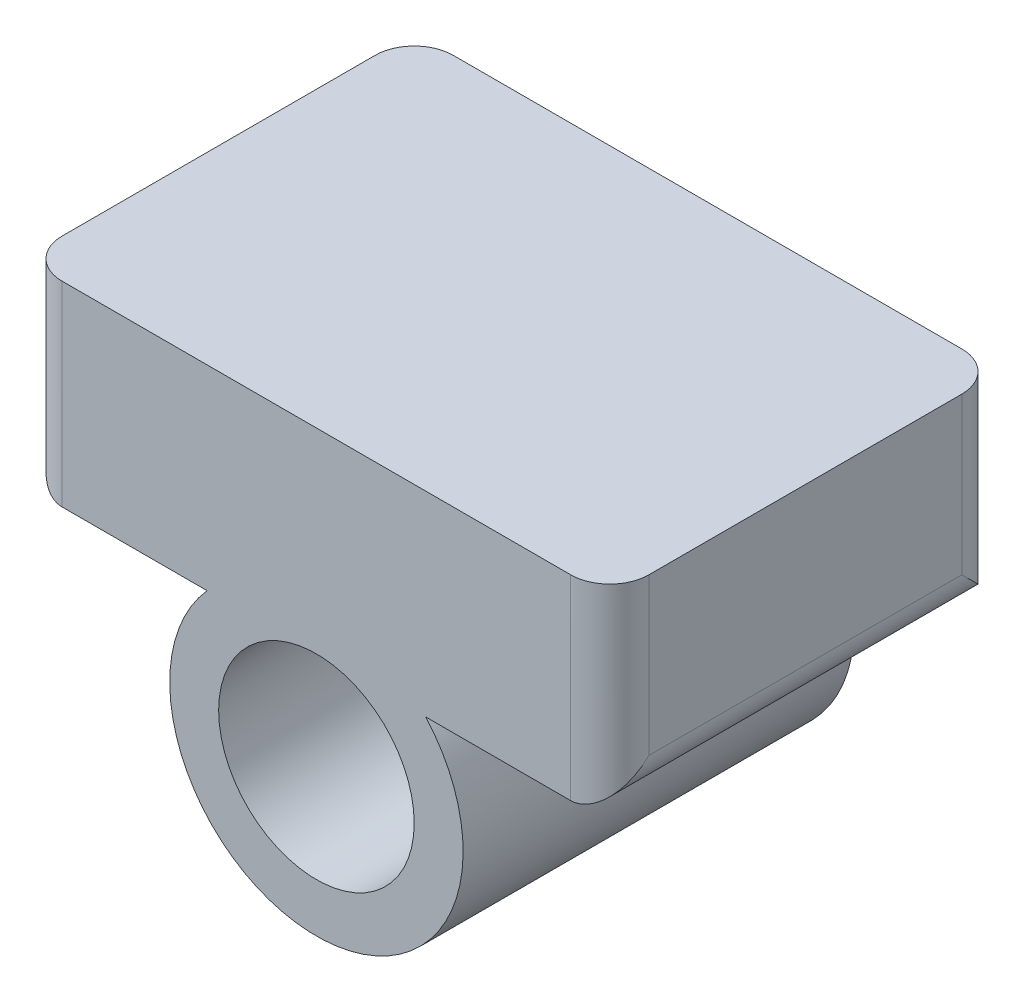
ISO-10303-21;
HEADER;
FILE_DESCRIPTION(('STEP AP214'),'2;1');
FILE_NAME('part.step','',(''),(''),'','','');
FILE_SCHEMA(('AUTOMOTIVE_DESIGN { 1 0 10303 214 1 1 1 1 }'));
ENDSEC;
DATA;
#1=APPLICATION_CONTEXT('core data for automotive mechanical design processes');
#2=APPLICATION_PROTOCOL_DEFINITION('international standard','automotive_design',2000,#1);
#3=PRODUCT_CONTEXT('',#1,'mechanical');
#4=PRODUCT('Part','Part','',(#3));
#5=PRODUCT_RELATED_PRODUCT_CATEGORY('part','',(#4));
#6=PRODUCT_DEFINITION_FORMATION('','',#4);
#7=PRODUCT_DEFINITION_CONTEXT('part definition',#1,'design');
#8=PRODUCT_DEFINITION('design','',#6,#7);
#9=PRODUCT_DEFINITION_SHAPE('','',#8);
#10=(LENGTH_UNIT() NAMED_UNIT(*) SI_UNIT(.MILLI.,.METRE.));
#11=(NAMED_UNIT(*) PLANE_ANGLE_UNIT() SI_UNIT($,.RADIAN.));
#12=(NAMED_UNIT(*) SI_UNIT($,.STERADIAN.) SOLID_ANGLE_UNIT());
#13=UNCERTAINTY_MEASURE_WITH_UNIT(LENGTH_MEASURE(1.E-05),#10,'distance_accuracy_value','');
#14=(GEOMETRIC_REPRESENTATION_CONTEXT(3) GLOBAL_UNCERTAINTY_ASSIGNED_CONTEXT((#13)) GLOBAL_UNIT_ASSIGNED_CONTEXT((#10,
#11,#12)) REPRESENTATION_CONTEXT('',''));
#15=CARTESIAN_POINT('',(0.,0.,0.));
#16=DIRECTION('',(0.,0.,1.));
#17=DIRECTION('',(1.,0.,0.));
#18=AXIS2_PLACEMENT_3D('',#15,#16,#17);
#19=CARTESIAN_POINT('',(0.,5.,20.));
#20=DIRECTION('',(0.,-1.,0.));
#21=DIRECTION('',(0.,0.,-1.));
#22=AXIS2_PLACEMENT_3D('',#19,#20,#21);
#23=PLANE('',#22);
#24=DIRECTION('',(-1.,0.,0.));
#25=VECTOR('',#24,1.);
#26=CARTESIAN_POINT('',(0.,5.,20.));
#27=LINE('',#26,#25);
#28=CARTESIAN_POINT('',(-5.59016994374948,5.,20.));
#29=VERTEX_POINT('',#28);
#30=CARTESIAN_POINT('',(-13.,5.,20.));
#31=VERTEX_POINT('',#30);
#32=EDGE_CURVE('E119',#29,#31,#27,.T.);
#33=ORIENTED_EDGE('',*,*,#32,.T.);
#34=DIRECTION('',(0.,0.,-1.));
#35=VECTOR('',#34,1.);
#36=CARTESIAN_POINT('',(-13.,5.,20.));
#37=LINE('',#36,#35);
#38=CARTESIAN_POINT('',(-13.,5.,0.));
#39=VERTEX_POINT('',#38);
#40=EDGE_CURVE('E173',#31,#39,#37,.T.);
#41=ORIENTED_EDGE('',*,*,#40,.T.);
#42=DIRECTION('',(-1.,0.,0.));
#43=VECTOR('',#42,1.);
#44=CARTESIAN_POINT('',(0.,5.,0.));
#45=LINE('',#44,#43);
#46=CARTESIAN_POINT('',(-5.59016994374948,5.,0.));
#47=VERTEX_POINT('',#46);
#48=EDGE_CURVE('E122',#47,#39,#45,.T.);
#49=ORIENTED_EDGE('',*,*,#48,.F.);
#50=DIRECTION('',(0.,0.,-1.));
#51=VECTOR('',#50,1.);
#52=CARTESIAN_POINT('',(-5.59016994374948,5.,20.));
#53=LINE('',#52,#51);
#54=EDGE_CURVE('E115',#29,#47,#53,.T.);
#55=ORIENTED_EDGE('',*,*,#54,.F.);
#56=EDGE_LOOP('',(#33,#41,#49,#55));
#57=FACE_BOUND('',#56,.T.);
#58=ADVANCED_FACE('F35',(#57),#23,.T.);
#59=CARTESIAN_POINT('',(0.,0.,20.));
#60=DIRECTION('',(0.,0.,-1.));
#61=DIRECTION('',(-1.,0.,0.));
#62=AXIS2_PLACEMENT_3D('',#59,#60,#61);
#63=CYLINDRICAL_SURFACE('',#62,7.5);
#64=CARTESIAN_POINT('',(0.,0.,0.));
#65=DIRECTION('',(0.,0.,1.));
#66=DIRECTION('',(1.,0.,0.));
#67=AXIS2_PLACEMENT_3D('',#64,#65,#66);
#68=CIRCLE('',#67,7.5);
#69=CARTESIAN_POINT('',(5.59016994374948,5.,0.));
#70=VERTEX_POINT('',#69);
#71=EDGE_CURVE('E157',#47,#70,#68,.T.);
#72=ORIENTED_EDGE('',*,*,#71,.T.);
#73=DIRECTION('',(0.,0.,-1.));
#74=VECTOR('',#73,1.);
#75=CARTESIAN_POINT('',(5.59016994374948,5.,20.));
#76=LINE('',#75,#74);
#77=CARTESIAN_POINT('',(5.59016994374948,5.,20.));
#78=VERTEX_POINT('',#77);
#79=EDGE_CURVE('E127',#78,#70,#76,.T.);
#80=ORIENTED_EDGE('',*,*,#79,.F.);
#81=CARTESIAN_POINT('',(0.,0.,20.));
#82=DIRECTION('',(0.,0.,1.));
#83=DIRECTION('',(1.,0.,0.));
#84=AXIS2_PLACEMENT_3D('',#81,#82,#83);
#85=CIRCLE('',#84,7.5);
#86=EDGE_CURVE('E131',#29,#78,#85,.T.);
#87=ORIENTED_EDGE('',*,*,#86,.F.);
#88=ORIENTED_EDGE('',*,*,#54,.T.);
#89=EDGE_LOOP('',(#72,#80,#87,#88));
#90=FACE_BOUND('',#89,.T.);
#91=ADVANCED_FACE('F132',(#90),#63,.T.);
#92=CARTESIAN_POINT('',(13.,5.,0.));
#93=VERTEX_POINT('',#92);
#94=EDGE_CURVE('E158',#93,#70,#45,.T.);
#95=ORIENTED_EDGE('',*,*,#94,.F.);
#96=DIRECTION('',(0.,0.,-1.));
#97=VECTOR('',#96,1.);
#98=CARTESIAN_POINT('',(13.,5.,20.));
#99=LINE('',#98,#97);
#100=CARTESIAN_POINT('',(13.,5.,20.));
#101=VERTEX_POINT('',#100);
#102=EDGE_CURVE('E171',#93,#101,#99,.F.);
#103=ORIENTED_EDGE('',*,*,#102,.T.);
#104=EDGE_CURVE('E134',#101,#78,#27,.T.);
#105=ORIENTED_EDGE('',*,*,#104,.T.);
#106=ORIENTED_EDGE('',*,*,#79,.T.);
#107=EDGE_LOOP('',(#95,#103,#105,#106));
#108=FACE_BOUND('',#107,.T.);
#109=ADVANCED_FACE('F217',(#108),#23,.T.);
#110=CARTESIAN_POINT('',(15.,0.,20.));
#111=DIRECTION('',(-1.,0.,0.));
#112=DIRECTION('',(0.,0.,1.));
#113=AXIS2_PLACEMENT_3D('',#110,#111,#112);
#114=PLANE('',#113);
#115=DIRECTION('',(0.,0.,-1.));
#116=VECTOR('',#115,1.);
#117=CARTESIAN_POINT('',(15.,7.,0.));
#118=LINE('',#117,#116);
#119=CARTESIAN_POINT('',(15.,7.,18.));
#120=VERTEX_POINT('',#119);
#121=CARTESIAN_POINT('',(15.,7.,2.));
#122=VERTEX_POINT('',#121);
#123=EDGE_CURVE('E166',#120,#122,#118,.T.);
#124=ORIENTED_EDGE('',*,*,#123,.T.);
#125=DIRECTION('',(0.,1.,0.));
#126=VECTOR('',#125,1.);
#127=CARTESIAN_POINT('',(15.,0.,2.));
#128=LINE('',#127,#126);
#129=CARTESIAN_POINT('',(15.,15.,2.));
#130=VERTEX_POINT('',#129);
#131=EDGE_CURVE('E169',#122,#130,#128,.T.);
#132=ORIENTED_EDGE('',*,*,#131,.T.);
#133=DIRECTION('',(0.,0.,-1.));
#134=VECTOR('',#133,1.);
#135=CARTESIAN_POINT('',(15.,15.,20.));
#136=LINE('',#135,#134);
#137=CARTESIAN_POINT('',(15.,15.,18.));
#138=VERTEX_POINT('',#137);
#139=EDGE_CURVE('E149',#138,#130,#136,.T.);
#140=ORIENTED_EDGE('',*,*,#139,.F.);
#141=DIRECTION('',(0.,1.,0.));
#142=VECTOR('',#141,1.);
#143=CARTESIAN_POINT('',(15.,5.,18.));
#144=LINE('',#143,#142);
#145=EDGE_CURVE('E126',#138,#120,#144,.F.);
#146=ORIENTED_EDGE('',*,*,#145,.T.);
#147=EDGE_LOOP('',(#124,#132,#140,#146));
#148=FACE_BOUND('',#147,.T.);
#149=ADVANCED_FACE('F219',(#148),#114,.F.);
#150=CARTESIAN_POINT('',(0.,15.,20.));
#151=DIRECTION('',(0.,-1.,0.));
#152=DIRECTION('',(0.,0.,-1.));
#153=AXIS2_PLACEMENT_3D('',#150,#151,#152);
#154=PLANE('',#153);
#155=DIRECTION('',(0.,0.,-1.));
#156=VECTOR('',#155,1.);
#157=CARTESIAN_POINT('',(-15.,15.,20.));
#158=LINE('',#157,#156);
#159=CARTESIAN_POINT('',(-15.,15.,18.));
#160=VERTEX_POINT('',#159);
#161=CARTESIAN_POINT('',(-15.,15.,2.));
#162=VERTEX_POINT('',#161);
#163=EDGE_CURVE('E146',#160,#162,#158,.T.);
#164=ORIENTED_EDGE('',*,*,#163,.F.);
#165=CARTESIAN_POINT('',(-13.,15.,18.));
#166=DIRECTION('',(0.,-1.,0.));
#167=DIRECTION('',(0.,0.,-1.));
#168=AXIS2_PLACEMENT_3D('',#165,#166,#167);
#169=CIRCLE('',#168,2.);
#170=CARTESIAN_POINT('',(-13.,15.,20.));
#171=VERTEX_POINT('',#170);
#172=EDGE_CURVE('E52',#160,#171,#169,.F.);
#173=ORIENTED_EDGE('',*,*,#172,.T.);
#174=DIRECTION('',(-1.,0.,0.));
#175=VECTOR('',#174,1.);
#176=CARTESIAN_POINT('',(0.,15.,20.));
#177=LINE('',#176,#175);
#178=CARTESIAN_POINT('',(13.,15.,20.));
#179=VERTEX_POINT('',#178);
#180=EDGE_CURVE('E144',#179,#171,#177,.T.);
#181=ORIENTED_EDGE('',*,*,#180,.F.);
#182=CARTESIAN_POINT('',(13.,15.,18.));
#183=DIRECTION('',(0.,-1.,0.));
#184=DIRECTION('',(0.,0.,-1.));
#185=AXIS2_PLACEMENT_3D('',#182,#183,#184);
#186=CIRCLE('',#185,2.);
#187=EDGE_CURVE('E181',#179,#138,#186,.F.);
#188=ORIENTED_EDGE('',*,*,#187,.T.);
#189=ORIENTED_EDGE('',*,*,#139,.T.);
#190=CARTESIAN_POINT('',(13.,15.,2.));
#191=DIRECTION('',(0.,-1.,0.));
#192=DIRECTION('',(0.,0.,-1.));
#193=AXIS2_PLACEMENT_3D('',#190,#191,#192);
#194=CIRCLE('',#193,2.);
#195=CARTESIAN_POINT('',(13.,15.,0.));
#196=VERTEX_POINT('',#195);
#197=EDGE_CURVE('E183',#130,#196,#194,.F.);
#198=ORIENTED_EDGE('',*,*,#197,.T.);
#199=DIRECTION('',(-1.,0.,0.));
#200=VECTOR('',#199,1.);
#201=CARTESIAN_POINT('',(0.,15.,0.));
#202=LINE('',#201,#200);
#203=CARTESIAN_POINT('',(-13.,15.,0.));
#204=VERTEX_POINT('',#203);
#205=EDGE_CURVE('E142',#196,#204,#202,.T.);
#206=ORIENTED_EDGE('',*,*,#205,.T.);
#207=CARTESIAN_POINT('',(-13.,15.,2.));
#208=DIRECTION('',(0.,-1.,0.));
#209=DIRECTION('',(0.,0.,-1.));
#210=AXIS2_PLACEMENT_3D('',#207,#208,#209);
#211=CIRCLE('',#210,2.);
#212=EDGE_CURVE('E185',#204,#162,#211,.F.);
#213=ORIENTED_EDGE('',*,*,#212,.T.);
#214=EDGE_LOOP('',(#164,#173,#181,#188,#189,#198,#206,#213));
#215=FACE_BOUND('',#214,.T.);
#216=ADVANCED_FACE('F207',(#215),#154,.F.);
#217=CARTESIAN_POINT('',(0.,0.,20.));
#218=DIRECTION('',(0.,0.,-1.));
#219=DIRECTION('',(-1.,0.,0.));
#220=AXIS2_PLACEMENT_3D('',#217,#218,#219);
#221=CYLINDRICAL_SURFACE('',#220,5.);
#222=CARTESIAN_POINT('',(0.,0.,20.));
#223=DIRECTION('',(0.,0.,1.));
#224=DIRECTION('',(1.,0.,0.));
#225=AXIS2_PLACEMENT_3D('',#222,#223,#224);
#226=CIRCLE('',#225,5.);
#227=CARTESIAN_POINT('',(5.,0.,20.));
#228=VERTEX_POINT('',#227);
#229=EDGE_CURVE('E139',#228,#228,#226,.T.);
#230=ORIENTED_EDGE('',*,*,#229,.T.);
#231=EDGE_LOOP('',(#230));
#232=FACE_BOUND('',#231,.T.);
#233=CARTESIAN_POINT('',(0.,0.,0.));
#234=DIRECTION('',(0.,0.,1.));
#235=DIRECTION('',(1.,0.,0.));
#236=AXIS2_PLACEMENT_3D('',#233,#234,#235);
#237=CIRCLE('',#236,5.);
#238=CARTESIAN_POINT('',(5.,0.,0.));
#239=VERTEX_POINT('',#238);
#240=EDGE_CURVE('E152',#239,#239,#237,.T.);
#241=ORIENTED_EDGE('',*,*,#240,.F.);
#242=EDGE_LOOP('',(#241));
#243=FACE_BOUND('',#242,.T.);
#244=ADVANCED_FACE('F241',(#232,#243),#221,.F.);
#245=CARTESIAN_POINT('',(-15.,0.,20.));
#246=DIRECTION('',(-1.,0.,0.));
#247=DIRECTION('',(0.,0.,1.));
#248=AXIS2_PLACEMENT_3D('',#245,#246,#247);
#249=PLANE('',#248);
#250=DIRECTION('',(0.,0.,-1.));
#251=VECTOR('',#250,1.);
#252=CARTESIAN_POINT('',(-15.,7.,20.));
#253=LINE('',#252,#251);
#254=CARTESIAN_POINT('',(-15.,7.,2.));
#255=VERTEX_POINT('',#254);
#256=CARTESIAN_POINT('',(-15.,7.,18.));
#257=VERTEX_POINT('',#256);
#258=EDGE_CURVE('E177',#255,#257,#253,.F.);
#259=ORIENTED_EDGE('',*,*,#258,.T.);
#260=DIRECTION('',(0.,1.,0.));
#261=VECTOR('',#260,1.);
#262=CARTESIAN_POINT('',(-15.,0.,18.));
#263=LINE('',#262,#261);
#264=EDGE_CURVE('E179',#257,#160,#263,.T.);
#265=ORIENTED_EDGE('',*,*,#264,.T.);
#266=ORIENTED_EDGE('',*,*,#163,.T.);
#267=DIRECTION('',(0.,1.,0.));
#268=VECTOR('',#267,1.);
#269=CARTESIAN_POINT('',(-15.,5.,2.));
#270=LINE('',#269,#268);
#271=EDGE_CURVE('E175',#162,#255,#270,.F.);
#272=ORIENTED_EDGE('',*,*,#271,.T.);
#273=EDGE_LOOP('',(#259,#265,#266,#272));
#274=FACE_BOUND('',#273,.T.);
#275=ADVANCED_FACE('F205',(#274),#249,.T.);
#276=CARTESIAN_POINT('',(0.,0.,20.));
#277=DIRECTION('',(0.,0.,1.));
#278=DIRECTION('',(1.,0.,0.));
#279=AXIS2_PLACEMENT_3D('',#276,#277,#278);
#280=PLANE('',#279);
#281=ORIENTED_EDGE('',*,*,#229,.F.);
#282=EDGE_LOOP('',(#281));
#283=FACE_BOUND('',#282,.T.);
#284=ORIENTED_EDGE('',*,*,#180,.T.);
#285=DIRECTION('',(0.,1.,0.));
#286=VECTOR('',#285,1.);
#287=CARTESIAN_POINT('',(-13.,0.,20.));
#288=LINE('',#287,#286);
#289=EDGE_CURVE('E138',#171,#31,#288,.F.);
#290=ORIENTED_EDGE('',*,*,#289,.T.);
#291=ORIENTED_EDGE('',*,*,#32,.F.);
#292=ORIENTED_EDGE('',*,*,#86,.T.);
#293=ORIENTED_EDGE('',*,*,#104,.F.);
#294=DIRECTION('',(0.,1.,0.));
#295=VECTOR('',#294,1.);
#296=CARTESIAN_POINT('',(13.,15.,20.));
#297=LINE('',#296,#295);
#298=EDGE_CURVE('E59',#101,#179,#297,.T.);
#299=ORIENTED_EDGE('',*,*,#298,.T.);
#300=EDGE_LOOP('',(#284,#290,#291,#292,#293,#299));
#301=FACE_BOUND('',#300,.T.);
#302=ADVANCED_FACE('F136',(#283,#301),#280,.T.);
#303=CARTESIAN_POINT('',(0.,0.,0.));
#304=DIRECTION('',(0.,0.,1.));
#305=DIRECTION('',(1.,0.,0.));
#306=AXIS2_PLACEMENT_3D('',#303,#304,#305);
#307=PLANE('',#306);
#308=ORIENTED_EDGE('',*,*,#240,.T.);
#309=EDGE_LOOP('',(#308));
#310=FACE_BOUND('',#309,.T.);
#311=ORIENTED_EDGE('',*,*,#48,.T.);
#312=DIRECTION('',(0.,1.,0.));
#313=VECTOR('',#312,1.);
#314=CARTESIAN_POINT('',(-13.,15.,0.));
#315=LINE('',#314,#313);
#316=EDGE_CURVE('E11',#39,#204,#315,.T.);
#317=ORIENTED_EDGE('',*,*,#316,.T.);
#318=ORIENTED_EDGE('',*,*,#205,.F.);
#319=DIRECTION('',(0.,1.,0.));
#320=VECTOR('',#319,1.);
#321=CARTESIAN_POINT('',(13.,0.,0.));
#322=LINE('',#321,#320);
#323=EDGE_CURVE('E44',#196,#93,#322,.F.);
#324=ORIENTED_EDGE('',*,*,#323,.T.);
#325=ORIENTED_EDGE('',*,*,#94,.T.);
#326=ORIENTED_EDGE('',*,*,#71,.F.);
#327=EDGE_LOOP('',(#311,#317,#318,#324,#325,#326));
#328=FACE_BOUND('',#327,.T.);
#329=ADVANCED_FACE('F213',(#310,#328),#307,.F.);
#330=CARTESIAN_POINT('',(13.,0.,18.));
#331=DIRECTION('',(0.,-1.,0.));
#332=DIRECTION('',(0.,0.,-1.));
#333=AXIS2_PLACEMENT_3D('',#330,#331,#332);
#334=CYLINDRICAL_SURFACE('',#333,2.);
#335=ORIENTED_EDGE('',*,*,#187,.F.);
#336=ORIENTED_EDGE('',*,*,#298,.F.);
#337=CARTESIAN_POINT('',(13.,7.,18.));
#338=DIRECTION('',(0.,-0.707106781186547,-0.707106781186547));
#339=DIRECTION('',(0.,-0.707106781186547,0.707106781186547));
#340=AXIS2_PLACEMENT_3D('',#337,#338,#339);
#341=ELLIPSE('',#340,2.82842712474619,2.);
#342=EDGE_CURVE('E155',#120,#101,#341,.T.);
#343=ORIENTED_EDGE('',*,*,#342,.F.);
#344=ORIENTED_EDGE('',*,*,#145,.F.);
#345=EDGE_LOOP('',(#335,#336,#343,#344));
#346=FACE_BOUND('',#345,.T.);
#347=ADVANCED_FACE('F271',(#346),#334,.T.);
#348=CARTESIAN_POINT('',(13.,0.,2.));
#349=DIRECTION('',(0.,1.,0.));
#350=DIRECTION('',(0.,0.,1.));
#351=AXIS2_PLACEMENT_3D('',#348,#349,#350);
#352=CYLINDRICAL_SURFACE('',#351,2.);
#353=ORIENTED_EDGE('',*,*,#197,.F.);
#354=ORIENTED_EDGE('',*,*,#131,.F.);
#355=CARTESIAN_POINT('',(13.,7.,2.));
#356=DIRECTION('',(0.,0.707106781186547,-0.707106781186547));
#357=DIRECTION('',(0.,0.707106781186547,0.707106781186547));
#358=AXIS2_PLACEMENT_3D('',#355,#356,#357);
#359=ELLIPSE('',#358,2.82842712474619,2.);
#360=EDGE_CURVE('E191',#93,#122,#359,.F.);
#361=ORIENTED_EDGE('',*,*,#360,.F.);
#362=ORIENTED_EDGE('',*,*,#323,.F.);
#363=EDGE_LOOP('',(#353,#354,#361,#362));
#364=FACE_BOUND('',#363,.T.);
#365=ADVANCED_FACE('F279',(#364),#352,.T.);
#366=CARTESIAN_POINT('',(13.,7.,20.));
#367=DIRECTION('',(0.,0.,1.));
#368=DIRECTION('',(1.,0.,0.));
#369=AXIS2_PLACEMENT_3D('',#366,#367,#368);
#370=CYLINDRICAL_SURFACE('',#369,2.);
#371=ORIENTED_EDGE('',*,*,#342,.T.);
#372=ORIENTED_EDGE('',*,*,#102,.F.);
#373=ORIENTED_EDGE('',*,*,#360,.T.);
#374=ORIENTED_EDGE('',*,*,#123,.F.);
#375=EDGE_LOOP('',(#371,#372,#373,#374));
#376=FACE_BOUND('',#375,.T.);
#377=ADVANCED_FACE('F287',(#376),#370,.T.);
#378=CARTESIAN_POINT('',(-13.,0.,18.));
#379=DIRECTION('',(0.,1.,0.));
#380=DIRECTION('',(0.,0.,1.));
#381=AXIS2_PLACEMENT_3D('',#378,#379,#380);
#382=CYLINDRICAL_SURFACE('',#381,2.);
#383=ORIENTED_EDGE('',*,*,#172,.F.);
#384=ORIENTED_EDGE('',*,*,#264,.F.);
#385=CARTESIAN_POINT('',(-13.,7.,18.));
#386=DIRECTION('',(0.,0.707106781186547,0.707106781186547));
#387=DIRECTION('',(0.,0.707106781186547,-0.707106781186547));
#388=AXIS2_PLACEMENT_3D('',#385,#386,#387);
#389=ELLIPSE('',#388,2.82842712474619,2.);
#390=EDGE_CURVE('E39',#31,#257,#389,.F.);
#391=ORIENTED_EDGE('',*,*,#390,.F.);
#392=ORIENTED_EDGE('',*,*,#289,.F.);
#393=EDGE_LOOP('',(#383,#384,#391,#392));
#394=FACE_BOUND('',#393,.T.);
#395=ADVANCED_FACE('F37',(#394),#382,.T.);
#396=CARTESIAN_POINT('',(-13.,0.,2.));
#397=DIRECTION('',(0.,-1.,0.));
#398=DIRECTION('',(0.,0.,-1.));
#399=AXIS2_PLACEMENT_3D('',#396,#397,#398);
#400=CYLINDRICAL_SURFACE('',#399,2.);
#401=ORIENTED_EDGE('',*,*,#212,.F.);
#402=ORIENTED_EDGE('',*,*,#316,.F.);
#403=CARTESIAN_POINT('',(-13.,7.,2.));
#404=DIRECTION('',(0.,-0.707106781186547,0.707106781186547));
#405=DIRECTION('',(0.,-0.707106781186547,-0.707106781186547));
#406=AXIS2_PLACEMENT_3D('',#403,#404,#405);
#407=ELLIPSE('',#406,2.82842712474619,2.);
#408=EDGE_CURVE('E194',#255,#39,#407,.T.);
#409=ORIENTED_EDGE('',*,*,#408,.F.);
#410=ORIENTED_EDGE('',*,*,#271,.F.);
#411=EDGE_LOOP('',(#401,#402,#409,#410));
#412=FACE_BOUND('',#411,.T.);
#413=ADVANCED_FACE('F211',(#412),#400,.T.);
#414=CARTESIAN_POINT('',(-13.,7.,20.));
#415=DIRECTION('',(0.,0.,-1.));
#416=DIRECTION('',(-1.,0.,0.));
#417=AXIS2_PLACEMENT_3D('',#414,#415,#416);
#418=CYLINDRICAL_SURFACE('',#417,2.);
#419=ORIENTED_EDGE('',*,*,#390,.T.);
#420=ORIENTED_EDGE('',*,*,#258,.F.);
#421=ORIENTED_EDGE('',*,*,#408,.T.);
#422=ORIENTED_EDGE('',*,*,#40,.F.);
#423=EDGE_LOOP('',(#419,#420,#421,#422));
#424=FACE_BOUND('',#423,.T.);
#425=ADVANCED_FACE('F201',(#424),#418,.T.);
#426=CLOSED_SHELL('',(#58,#91,#109,#149,#216,#244,#275,#302,#329,#347,#365,#377,#395,#413,#425));
#427=MANIFOLD_SOLID_BREP('B2',#426);
#428=ADVANCED_BREP_SHAPE_REPRESENTATION('',(#18,#427),#14);
#429=SHAPE_DEFINITION_REPRESENTATION(#9,#428);
ENDSEC;
END-ISO-10303-21;
